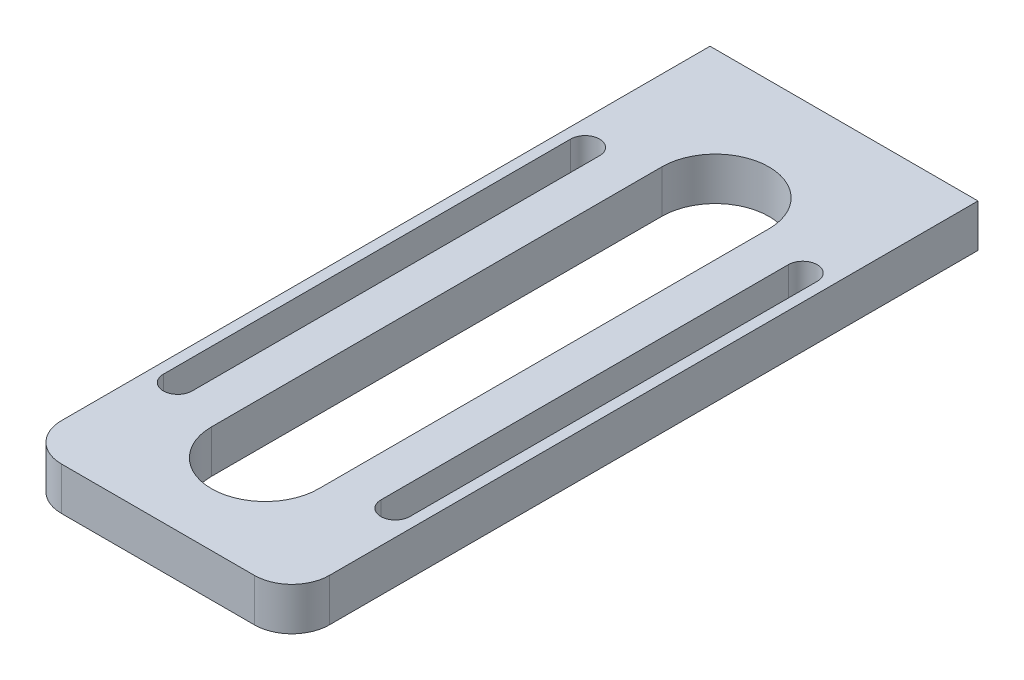
ISO-10303-21;
HEADER;
FILE_DESCRIPTION(('STEP AP214'),'2;1');
FILE_NAME('part.step','',(''),(''),'','','');
FILE_SCHEMA(('AUTOMOTIVE_DESIGN { 1 0 10303 214 1 1 1 1 }'));
ENDSEC;
DATA;
#1=APPLICATION_CONTEXT('core data for automotive mechanical design processes');
#2=APPLICATION_PROTOCOL_DEFINITION('international standard','automotive_design',2000,#1);
#3=PRODUCT_CONTEXT('',#1,'mechanical');
#4=PRODUCT('Part','Part','',(#3));
#5=PRODUCT_RELATED_PRODUCT_CATEGORY('part','',(#4));
#6=PRODUCT_DEFINITION_FORMATION('','',#4);
#7=PRODUCT_DEFINITION_CONTEXT('part definition',#1,'design');
#8=PRODUCT_DEFINITION('design','',#6,#7);
#9=PRODUCT_DEFINITION_SHAPE('','',#8);
#10=(LENGTH_UNIT() NAMED_UNIT(*) SI_UNIT(.MILLI.,.METRE.));
#11=(NAMED_UNIT(*) PLANE_ANGLE_UNIT() SI_UNIT($,.RADIAN.));
#12=(NAMED_UNIT(*) SI_UNIT($,.STERADIAN.) SOLID_ANGLE_UNIT());
#13=UNCERTAINTY_MEASURE_WITH_UNIT(LENGTH_MEASURE(1.E-05),#10,'distance_accuracy_value','');
#14=(GEOMETRIC_REPRESENTATION_CONTEXT(3) GLOBAL_UNCERTAINTY_ASSIGNED_CONTEXT((#13)) GLOBAL_UNIT_ASSIGNED_CONTEXT((#10,
#11,#12)) REPRESENTATION_CONTEXT('',''));
#15=CARTESIAN_POINT('',(0.,0.,0.));
#16=DIRECTION('',(0.,0.,1.));
#17=DIRECTION('',(1.,0.,0.));
#18=AXIS2_PLACEMENT_3D('',#15,#16,#17);
#19=CARTESIAN_POINT('',(-7.50000000000001,0.,-27.));
#20=DIRECTION('',(0.,0.,-1.));
#21=DIRECTION('',(-1.,0.,0.));
#22=AXIS2_PLACEMENT_3D('',#19,#20,#21);
#23=PLANE('',#22);
#24=CARTESIAN_POINT('',(-7.50000000000001,0.,-27.));
#25=DIRECTION('',(0.,0.,1.));
#26=DIRECTION('',(1.,0.,0.));
#27=AXIS2_PLACEMENT_3D('',#24,#25,#26);
#28=CIRCLE('',#27,1.25);
#29=CARTESIAN_POINT('',(-6.25000000000001,0.,-27.));
#30=VERTEX_POINT('',#29);
#31=EDGE_CURVE('E20',#30,#30,#28,.F.);
#32=ORIENTED_EDGE('',*,*,#31,.T.);
#33=EDGE_LOOP('',(#32));
#34=FACE_BOUND('',#33,.T.);
#35=ADVANCED_FACE('F17',(#34),#23,.T.);
#36=CARTESIAN_POINT('',(7.49999999999999,0.,-27.));
#37=DIRECTION('',(0.,0.,-1.));
#38=DIRECTION('',(-1.,0.,0.));
#39=AXIS2_PLACEMENT_3D('',#36,#37,#38);
#40=PLANE('',#39);
#41=CARTESIAN_POINT('',(7.49999999999999,0.,-27.));
#42=DIRECTION('',(0.,0.,1.));
#43=DIRECTION('',(1.,0.,0.));
#44=AXIS2_PLACEMENT_3D('',#41,#42,#43);
#45=CIRCLE('',#44,1.25);
#46=CARTESIAN_POINT('',(8.74999999999999,0.,-27.));
#47=VERTEX_POINT('',#46);
#48=EDGE_CURVE('E215',#47,#47,#45,.F.);
#49=ORIENTED_EDGE('',*,*,#48,.T.);
#50=EDGE_LOOP('',(#49));
#51=FACE_BOUND('',#50,.T.);
#52=ADVANCED_FACE('F282',(#51),#40,.T.);
#53=CARTESIAN_POINT('',(-7.50000000000001,0.,-32.));
#54=DIRECTION('',(0.,0.,1.));
#55=DIRECTION('',(1.,0.,0.));
#56=AXIS2_PLACEMENT_3D('',#53,#54,#55);
#57=CYLINDRICAL_SURFACE('',#56,1.25);
#58=ORIENTED_EDGE('',*,*,#31,.F.);
#59=EDGE_LOOP('',(#58));
#60=FACE_BOUND('',#59,.T.);
#61=CARTESIAN_POINT('',(-7.50000000000001,0.,-32.));
#62=DIRECTION('',(0.,0.,1.));
#63=DIRECTION('',(1.,0.,0.));
#64=AXIS2_PLACEMENT_3D('',#61,#62,#63);
#65=CIRCLE('',#64,1.25);
#66=CARTESIAN_POINT('',(-6.25000000000001,0.,-32.));
#67=VERTEX_POINT('',#66);
#68=EDGE_CURVE('E182',#67,#67,#65,.T.);
#69=ORIENTED_EDGE('',*,*,#68,.F.);
#70=EDGE_LOOP('',(#69));
#71=FACE_BOUND('',#70,.T.);
#72=ADVANCED_FACE('F278',(#60,#71),#57,.F.);
#73=CARTESIAN_POINT('',(7.49999999999999,0.,-32.));
#74=DIRECTION('',(0.,0.,1.));
#75=DIRECTION('',(1.,0.,0.));
#76=AXIS2_PLACEMENT_3D('',#73,#74,#75);
#77=CYLINDRICAL_SURFACE('',#76,1.25);
#78=ORIENTED_EDGE('',*,*,#48,.F.);
#79=EDGE_LOOP('',(#78));
#80=FACE_BOUND('',#79,.T.);
#81=CARTESIAN_POINT('',(7.49999999999999,0.,-32.));
#82=DIRECTION('',(0.,0.,1.));
#83=DIRECTION('',(1.,0.,0.));
#84=AXIS2_PLACEMENT_3D('',#81,#82,#83);
#85=CIRCLE('',#84,1.25);
#86=CARTESIAN_POINT('',(8.74999999999999,0.,-32.));
#87=VERTEX_POINT('',#86);
#88=EDGE_CURVE('E219',#87,#87,#85,.T.);
#89=ORIENTED_EDGE('',*,*,#88,.F.);
#90=EDGE_LOOP('',(#89));
#91=FACE_BOUND('',#90,.T.);
#92=ADVANCED_FACE('F281',(#80,#91),#77,.F.);
#93=CARTESIAN_POINT('',(0.,2.,0.));
#94=DIRECTION('',(0.,1.,0.));
#95=DIRECTION('',(0.,0.,1.));
#96=AXIS2_PLACEMENT_3D('',#93,#94,#95);
#97=PLANE('',#96);
#98=CARTESIAN_POINT('',(-10.15,2.,20.));
#99=DIRECTION('',(0.,-1.,0.));
#100=DIRECTION('',(0.,0.,-1.));
#101=AXIS2_PLACEMENT_3D('',#98,#99,#100);
#102=CIRCLE('',#101,1.35);
#103=CARTESIAN_POINT('',(-8.8,2.,20.));
#104=VERTEX_POINT('',#103);
#105=CARTESIAN_POINT('',(-11.5,2.,20.));
#106=VERTEX_POINT('',#105);
#107=EDGE_CURVE('E253',#104,#106,#102,.T.);
#108=ORIENTED_EDGE('',*,*,#107,.T.);
#109=DIRECTION('',(0.,0.,1.));
#110=VECTOR('',#109,1.);
#111=CARTESIAN_POINT('',(-11.5,2.,20.));
#112=LINE('',#111,#110);
#113=CARTESIAN_POINT('',(-11.5,2.,-18.));
#114=VERTEX_POINT('',#113);
#115=EDGE_CURVE('E190',#106,#114,#112,.F.);
#116=ORIENTED_EDGE('',*,*,#115,.T.);
#117=CARTESIAN_POINT('',(-10.15,2.,-18.));
#118=DIRECTION('',(0.,-1.,0.));
#119=DIRECTION('',(0.,0.,-1.));
#120=AXIS2_PLACEMENT_3D('',#117,#118,#119);
#121=CIRCLE('',#120,1.35);
#122=CARTESIAN_POINT('',(-8.8,2.,-18.));
#123=VERTEX_POINT('',#122);
#124=EDGE_CURVE('E250',#114,#123,#121,.T.);
#125=ORIENTED_EDGE('',*,*,#124,.T.);
#126=DIRECTION('',(0.,0.,-1.));
#127=VECTOR('',#126,1.);
#128=CARTESIAN_POINT('',(-8.8,2.,-18.));
#129=LINE('',#128,#127);
#130=EDGE_CURVE('E186',#123,#104,#129,.F.);
#131=ORIENTED_EDGE('',*,*,#130,.T.);
#132=EDGE_LOOP('',(#108,#116,#125,#131));
#133=FACE_BOUND('',#132,.T.);
#134=DIRECTION('',(0.,0.,1.));
#135=VECTOR('',#134,1.);
#136=CARTESIAN_POINT('',(-5.,2.,22.));
#137=LINE('',#136,#135);
#138=CARTESIAN_POINT('',(-5.,2.,22.));
#139=VERTEX_POINT('',#138);
#140=CARTESIAN_POINT('',(-5.,2.,-20.));
#141=VERTEX_POINT('',#140);
#142=EDGE_CURVE('E197',#139,#141,#137,.F.);
#143=ORIENTED_EDGE('',*,*,#142,.T.);
#144=CARTESIAN_POINT('',(0.,2.,-20.));
#145=DIRECTION('',(0.,-1.,0.));
#146=DIRECTION('',(0.,0.,-1.));
#147=AXIS2_PLACEMENT_3D('',#144,#145,#146);
#148=CIRCLE('',#147,5.);
#149=CARTESIAN_POINT('',(5.,2.,-20.));
#150=VERTEX_POINT('',#149);
#151=EDGE_CURVE('E255',#141,#150,#148,.T.);
#152=ORIENTED_EDGE('',*,*,#151,.T.);
#153=DIRECTION('',(0.,0.,-1.));
#154=VECTOR('',#153,1.);
#155=CARTESIAN_POINT('',(5.,2.,-20.));
#156=LINE('',#155,#154);
#157=CARTESIAN_POINT('',(5.,2.,22.));
#158=VERTEX_POINT('',#157);
#159=EDGE_CURVE('E193',#150,#158,#156,.F.);
#160=ORIENTED_EDGE('',*,*,#159,.T.);
#161=CARTESIAN_POINT('',(0.,2.,22.));
#162=DIRECTION('',(0.,-1.,0.));
#163=DIRECTION('',(0.,0.,-1.));
#164=AXIS2_PLACEMENT_3D('',#161,#162,#163);
#165=CIRCLE('',#164,5.);
#166=EDGE_CURVE('E257',#158,#139,#165,.T.);
#167=ORIENTED_EDGE('',*,*,#166,.T.);
#168=EDGE_LOOP('',(#143,#152,#160,#167));
#169=FACE_BOUND('',#168,.T.);
#170=DIRECTION('',(0.,0.,1.));
#171=VECTOR('',#170,1.);
#172=CARTESIAN_POINT('',(8.8,2.,20.));
#173=LINE('',#172,#171);
#174=CARTESIAN_POINT('',(8.8,2.,20.));
#175=VERTEX_POINT('',#174);
#176=CARTESIAN_POINT('',(8.8,2.,-18.));
#177=VERTEX_POINT('',#176);
#178=EDGE_CURVE('E206',#175,#177,#173,.F.);
#179=ORIENTED_EDGE('',*,*,#178,.T.);
#180=CARTESIAN_POINT('',(10.15,2.,-18.));
#181=DIRECTION('',(0.,-1.,0.));
#182=DIRECTION('',(0.,0.,-1.));
#183=AXIS2_PLACEMENT_3D('',#180,#181,#182);
#184=CIRCLE('',#183,1.35);
#185=CARTESIAN_POINT('',(11.5,2.,-18.));
#186=VERTEX_POINT('',#185);
#187=EDGE_CURVE('E259',#177,#186,#184,.T.);
#188=ORIENTED_EDGE('',*,*,#187,.T.);
#189=DIRECTION('',(0.,0.,-1.));
#190=VECTOR('',#189,1.);
#191=CARTESIAN_POINT('',(11.5,2.,-18.));
#192=LINE('',#191,#190);
#193=CARTESIAN_POINT('',(11.5,2.,20.));
#194=VERTEX_POINT('',#193);
#195=EDGE_CURVE('E201',#186,#194,#192,.F.);
#196=ORIENTED_EDGE('',*,*,#195,.T.);
#197=CARTESIAN_POINT('',(10.15,2.,20.));
#198=DIRECTION('',(0.,-1.,0.));
#199=DIRECTION('',(0.,0.,-1.));
#200=AXIS2_PLACEMENT_3D('',#197,#198,#199);
#201=CIRCLE('',#200,1.35);
#202=EDGE_CURVE('E261',#194,#175,#201,.T.);
#203=ORIENTED_EDGE('',*,*,#202,.T.);
#204=EDGE_LOOP('',(#179,#188,#196,#203));
#205=FACE_BOUND('',#204,.T.);
#206=CARTESIAN_POINT('',(-8.99999999999998,2.,28.5));
#207=DIRECTION('',(0.,1.,0.));
#208=DIRECTION('',(0.,0.,1.));
#209=AXIS2_PLACEMENT_3D('',#206,#207,#208);
#210=CIRCLE('',#209,3.50000000000001);
#211=CARTESIAN_POINT('',(-8.99999999999998,2.,32.));
#212=VERTEX_POINT('',#211);
#213=CARTESIAN_POINT('',(-12.5,2.,28.5));
#214=VERTEX_POINT('',#213);
#215=EDGE_CURVE('E138',#212,#214,#210,.F.);
#216=ORIENTED_EDGE('',*,*,#215,.F.);
#217=DIRECTION('',(1.,0.,0.));
#218=VECTOR('',#217,1.);
#219=CARTESIAN_POINT('',(-8.99999999999999,2.,32.));
#220=LINE('',#219,#218);
#221=CARTESIAN_POINT('',(9.,2.,32.));
#222=VERTEX_POINT('',#221);
#223=EDGE_CURVE('E132',#222,#212,#220,.F.);
#224=ORIENTED_EDGE('',*,*,#223,.F.);
#225=CARTESIAN_POINT('',(9.,2.,28.5));
#226=DIRECTION('',(0.,1.,0.));
#227=DIRECTION('',(0.,0.,1.));
#228=AXIS2_PLACEMENT_3D('',#225,#226,#227);
#229=CIRCLE('',#228,3.50000000000001);
#230=CARTESIAN_POINT('',(12.5,2.,28.5));
#231=VERTEX_POINT('',#230);
#232=EDGE_CURVE('E264',#231,#222,#229,.F.);
#233=ORIENTED_EDGE('',*,*,#232,.F.);
#234=DIRECTION('',(0.,0.,-1.));
#235=VECTOR('',#234,1.);
#236=CARTESIAN_POINT('',(12.5,2.,28.5));
#237=LINE('',#236,#235);
#238=CARTESIAN_POINT('',(12.5,2.,-32.));
#239=VERTEX_POINT('',#238);
#240=EDGE_CURVE('E213',#239,#231,#237,.F.);
#241=ORIENTED_EDGE('',*,*,#240,.F.);
#242=DIRECTION('',(-1.,0.,0.));
#243=VECTOR('',#242,1.);
#244=CARTESIAN_POINT('',(12.5,2.,-32.));
#245=LINE('',#244,#243);
#246=CARTESIAN_POINT('',(-12.5,2.,-32.));
#247=VERTEX_POINT('',#246);
#248=EDGE_CURVE('E183',#247,#239,#245,.F.);
#249=ORIENTED_EDGE('',*,*,#248,.F.);
#250=DIRECTION('',(0.,0.,1.));
#251=VECTOR('',#250,1.);
#252=CARTESIAN_POINT('',(-12.5,2.,-32.));
#253=LINE('',#252,#251);
#254=EDGE_CURVE('E144',#214,#247,#253,.F.);
#255=ORIENTED_EDGE('',*,*,#254,.F.);
#256=EDGE_LOOP('',(#216,#224,#233,#241,#249,#255));
#257=FACE_BOUND('',#256,.T.);
#258=ADVANCED_FACE('F297',(#133,#169,#205,#257),#97,.T.);
#259=CARTESIAN_POINT('',(12.5,0.,28.5));
#260=DIRECTION('',(1.,0.,0.));
#261=DIRECTION('',(0.,0.,-1.));
#262=AXIS2_PLACEMENT_3D('',#259,#260,#261);
#263=PLANE('',#262);
#264=DIRECTION('',(0.,1.,0.));
#265=VECTOR('',#264,1.);
#266=CARTESIAN_POINT('',(12.5,0.,28.5));
#267=LINE('',#266,#265);
#268=CARTESIAN_POINT('',(12.5,-2.,28.5));
#269=VERTEX_POINT('',#268);
#270=EDGE_CURVE('E266',#269,#231,#267,.T.);
#271=ORIENTED_EDGE('',*,*,#270,.F.);
#272=DIRECTION('',(0.,0.,1.));
#273=VECTOR('',#272,1.);
#274=CARTESIAN_POINT('',(12.5,-2.,0.));
#275=LINE('',#274,#273);
#276=CARTESIAN_POINT('',(12.5,-2.,-32.));
#277=VERTEX_POINT('',#276);
#278=EDGE_CURVE('E172',#269,#277,#275,.F.);
#279=ORIENTED_EDGE('',*,*,#278,.T.);
#280=DIRECTION('',(0.,1.,0.));
#281=VECTOR('',#280,1.);
#282=CARTESIAN_POINT('',(12.5,0.,-32.));
#283=LINE('',#282,#281);
#284=EDGE_CURVE('E171',#239,#277,#283,.F.);
#285=ORIENTED_EDGE('',*,*,#284,.F.);
#286=ORIENTED_EDGE('',*,*,#240,.T.);
#287=EDGE_LOOP('',(#271,#279,#285,#286));
#288=FACE_BOUND('',#287,.T.);
#289=ADVANCED_FACE('F287',(#288),#263,.T.);
#290=CARTESIAN_POINT('',(12.5,0.,-32.));
#291=DIRECTION('',(0.,0.,-1.));
#292=DIRECTION('',(-1.,0.,0.));
#293=AXIS2_PLACEMENT_3D('',#290,#291,#292);
#294=PLANE('',#293);
#295=ORIENTED_EDGE('',*,*,#88,.T.);
#296=EDGE_LOOP('',(#295));
#297=FACE_BOUND('',#296,.T.);
#298=ORIENTED_EDGE('',*,*,#68,.T.);
#299=EDGE_LOOP('',(#298));
#300=FACE_BOUND('',#299,.T.);
#301=ORIENTED_EDGE('',*,*,#284,.T.);
#302=DIRECTION('',(1.,0.,0.));
#303=VECTOR('',#302,1.);
#304=CARTESIAN_POINT('',(0.,-2.,-32.));
#305=LINE('',#304,#303);
#306=CARTESIAN_POINT('',(-12.5,-2.,-32.));
#307=VERTEX_POINT('',#306);
#308=EDGE_CURVE('E164',#277,#307,#305,.F.);
#309=ORIENTED_EDGE('',*,*,#308,.T.);
#310=DIRECTION('',(0.,1.,0.));
#311=VECTOR('',#310,1.);
#312=CARTESIAN_POINT('',(-12.5,0.,-32.));
#313=LINE('',#312,#311);
#314=EDGE_CURVE('E152',#247,#307,#313,.F.);
#315=ORIENTED_EDGE('',*,*,#314,.F.);
#316=ORIENTED_EDGE('',*,*,#248,.T.);
#317=EDGE_LOOP('',(#301,#309,#315,#316));
#318=FACE_BOUND('',#317,.T.);
#319=ADVANCED_FACE('F169',(#297,#300,#318),#294,.T.);
#320=CARTESIAN_POINT('',(-12.5,0.,-32.));
#321=DIRECTION('',(-1.,0.,0.));
#322=DIRECTION('',(0.,0.,1.));
#323=AXIS2_PLACEMENT_3D('',#320,#321,#322);
#324=PLANE('',#323);
#325=ORIENTED_EDGE('',*,*,#314,.T.);
#326=DIRECTION('',(0.,0.,1.));
#327=VECTOR('',#326,1.);
#328=CARTESIAN_POINT('',(-12.5,-2.,0.));
#329=LINE('',#328,#327);
#330=CARTESIAN_POINT('',(-12.5,-2.,28.5));
#331=VERTEX_POINT('',#330);
#332=EDGE_CURVE('E155',#307,#331,#329,.T.);
#333=ORIENTED_EDGE('',*,*,#332,.T.);
#334=DIRECTION('',(0.,1.,0.));
#335=VECTOR('',#334,1.);
#336=CARTESIAN_POINT('',(-12.5,0.,28.5));
#337=LINE('',#336,#335);
#338=EDGE_CURVE('E212',#214,#331,#337,.F.);
#339=ORIENTED_EDGE('',*,*,#338,.F.);
#340=ORIENTED_EDGE('',*,*,#254,.T.);
#341=EDGE_LOOP('',(#325,#333,#339,#340));
#342=FACE_BOUND('',#341,.T.);
#343=ADVANCED_FACE('F154',(#342),#324,.T.);
#344=CARTESIAN_POINT('',(-8.99999999999998,0.,28.5));
#345=DIRECTION('',(0.,1.,0.));
#346=DIRECTION('',(0.,0.,1.));
#347=AXIS2_PLACEMENT_3D('',#344,#345,#346);
#348=CYLINDRICAL_SURFACE('',#347,3.50000000000001);
#349=ORIENTED_EDGE('',*,*,#338,.T.);
#350=CARTESIAN_POINT('',(-8.99999999999998,-2.,28.5));
#351=DIRECTION('',(0.,1.,0.));
#352=DIRECTION('',(0.,0.,1.));
#353=AXIS2_PLACEMENT_3D('',#350,#351,#352);
#354=CIRCLE('',#353,3.50000000000001);
#355=CARTESIAN_POINT('',(-8.99999999999998,-2.,32.));
#356=VERTEX_POINT('',#355);
#357=EDGE_CURVE('E167',#331,#356,#354,.T.);
#358=ORIENTED_EDGE('',*,*,#357,.T.);
#359=DIRECTION('',(0.,1.,0.));
#360=VECTOR('',#359,1.);
#361=CARTESIAN_POINT('',(-8.99999999999999,0.,32.));
#362=LINE('',#361,#360);
#363=EDGE_CURVE('E211',#212,#356,#362,.F.);
#364=ORIENTED_EDGE('',*,*,#363,.F.);
#365=ORIENTED_EDGE('',*,*,#215,.T.);
#366=EDGE_LOOP('',(#349,#358,#364,#365));
#367=FACE_BOUND('',#366,.T.);
#368=ADVANCED_FACE('F295',(#367),#348,.T.);
#369=CARTESIAN_POINT('',(-8.99999999999999,0.,32.));
#370=DIRECTION('',(0.,0.,1.));
#371=DIRECTION('',(1.,0.,0.));
#372=AXIS2_PLACEMENT_3D('',#369,#370,#371);
#373=PLANE('',#372);
#374=ORIENTED_EDGE('',*,*,#363,.T.);
#375=DIRECTION('',(1.,0.,0.));
#376=VECTOR('',#375,1.);
#377=CARTESIAN_POINT('',(0.,-2.,32.));
#378=LINE('',#377,#376);
#379=CARTESIAN_POINT('',(9.,-2.,32.));
#380=VERTEX_POINT('',#379);
#381=EDGE_CURVE('E248',#356,#380,#378,.T.);
#382=ORIENTED_EDGE('',*,*,#381,.T.);
#383=DIRECTION('',(0.,1.,0.));
#384=VECTOR('',#383,1.);
#385=CARTESIAN_POINT('',(9.,0.,32.));
#386=LINE('',#385,#384);
#387=EDGE_CURVE('E263',#222,#380,#386,.F.);
#388=ORIENTED_EDGE('',*,*,#387,.F.);
#389=ORIENTED_EDGE('',*,*,#223,.T.);
#390=EDGE_LOOP('',(#374,#382,#388,#389));
#391=FACE_BOUND('',#390,.T.);
#392=ADVANCED_FACE('F358',(#391),#373,.T.);
#393=CARTESIAN_POINT('',(9.,0.,28.5));
#394=DIRECTION('',(0.,1.,0.));
#395=DIRECTION('',(0.,0.,1.));
#396=AXIS2_PLACEMENT_3D('',#393,#394,#395);
#397=CYLINDRICAL_SURFACE('',#396,3.50000000000001);
#398=ORIENTED_EDGE('',*,*,#387,.T.);
#399=CARTESIAN_POINT('',(9.,-2.,28.5));
#400=DIRECTION('',(0.,1.,0.));
#401=DIRECTION('',(0.,0.,1.));
#402=AXIS2_PLACEMENT_3D('',#399,#400,#401);
#403=CIRCLE('',#402,3.50000000000001);
#404=EDGE_CURVE('E245',#380,#269,#403,.T.);
#405=ORIENTED_EDGE('',*,*,#404,.T.);
#406=ORIENTED_EDGE('',*,*,#270,.T.);
#407=ORIENTED_EDGE('',*,*,#232,.T.);
#408=EDGE_LOOP('',(#398,#405,#406,#407));
#409=FACE_BOUND('',#408,.T.);
#410=ADVANCED_FACE('F354',(#409),#397,.T.);
#411=CARTESIAN_POINT('',(10.15,2.,20.));
#412=DIRECTION('',(0.,-1.,0.));
#413=DIRECTION('',(0.,0.,-1.));
#414=AXIS2_PLACEMENT_3D('',#411,#412,#413);
#415=CYLINDRICAL_SURFACE('',#414,1.35);
#416=DIRECTION('',(0.,1.,0.));
#417=VECTOR('',#416,1.);
#418=CARTESIAN_POINT('',(8.8,2.,20.));
#419=LINE('',#418,#417);
#420=CARTESIAN_POINT('',(8.8,-2.,20.));
#421=VERTEX_POINT('',#420);
#422=EDGE_CURVE('E209',#421,#175,#419,.T.);
#423=ORIENTED_EDGE('',*,*,#422,.T.);
#424=ORIENTED_EDGE('',*,*,#202,.F.);
#425=DIRECTION('',(0.,1.,0.));
#426=VECTOR('',#425,1.);
#427=CARTESIAN_POINT('',(11.5,2.,20.));
#428=LINE('',#427,#426);
#429=CARTESIAN_POINT('',(11.5,-2.,20.));
#430=VERTEX_POINT('',#429);
#431=EDGE_CURVE('E204',#194,#430,#428,.F.);
#432=ORIENTED_EDGE('',*,*,#431,.T.);
#433=CARTESIAN_POINT('',(10.15,-2.,20.));
#434=DIRECTION('',(0.,-1.,0.));
#435=DIRECTION('',(0.,0.,-1.));
#436=AXIS2_PLACEMENT_3D('',#433,#434,#435);
#437=CIRCLE('',#436,1.35);
#438=EDGE_CURVE('E242',#430,#421,#437,.T.);
#439=ORIENTED_EDGE('',*,*,#438,.T.);
#440=EDGE_LOOP('',(#423,#424,#432,#439));
#441=FACE_BOUND('',#440,.T.);
#442=ADVANCED_FACE('F350',(#441),#415,.F.);
#443=CARTESIAN_POINT('',(8.8,2.,20.));
#444=DIRECTION('',(-1.,0.,0.));
#445=DIRECTION('',(0.,0.,1.));
#446=AXIS2_PLACEMENT_3D('',#443,#444,#445);
#447=PLANE('',#446);
#448=DIRECTION('',(0.,-1.,0.));
#449=VECTOR('',#448,1.);
#450=CARTESIAN_POINT('',(8.8,2.,-18.));
#451=LINE('',#450,#449);
#452=CARTESIAN_POINT('',(8.8,-2.,-18.));
#453=VERTEX_POINT('',#452);
#454=EDGE_CURVE('E208',#453,#177,#451,.F.);
#455=ORIENTED_EDGE('',*,*,#454,.T.);
#456=ORIENTED_EDGE('',*,*,#178,.F.);
#457=ORIENTED_EDGE('',*,*,#422,.F.);
#458=DIRECTION('',(0.,0.,1.));
#459=VECTOR('',#458,1.);
#460=CARTESIAN_POINT('',(8.8,-2.,0.));
#461=LINE('',#460,#459);
#462=EDGE_CURVE('E241',#421,#453,#461,.F.);
#463=ORIENTED_EDGE('',*,*,#462,.T.);
#464=EDGE_LOOP('',(#455,#456,#457,#463));
#465=FACE_BOUND('',#464,.T.);
#466=ADVANCED_FACE('F346',(#465),#447,.F.);
#467=CARTESIAN_POINT('',(10.15,2.,-18.));
#468=DIRECTION('',(0.,-1.,0.));
#469=DIRECTION('',(0.,0.,-1.));
#470=AXIS2_PLACEMENT_3D('',#467,#468,#469);
#471=CYLINDRICAL_SURFACE('',#470,1.35);
#472=DIRECTION('',(0.,1.,0.));
#473=VECTOR('',#472,1.);
#474=CARTESIAN_POINT('',(11.5,2.,-18.));
#475=LINE('',#474,#473);
#476=CARTESIAN_POINT('',(11.5,-2.,-18.));
#477=VERTEX_POINT('',#476);
#478=EDGE_CURVE('E205',#477,#186,#475,.T.);
#479=ORIENTED_EDGE('',*,*,#478,.T.);
#480=ORIENTED_EDGE('',*,*,#187,.F.);
#481=ORIENTED_EDGE('',*,*,#454,.F.);
#482=CARTESIAN_POINT('',(10.15,-2.,-18.));
#483=DIRECTION('',(0.,-1.,0.));
#484=DIRECTION('',(0.,0.,-1.));
#485=AXIS2_PLACEMENT_3D('',#482,#483,#484);
#486=CIRCLE('',#485,1.35);
#487=EDGE_CURVE('E238',#453,#477,#486,.T.);
#488=ORIENTED_EDGE('',*,*,#487,.T.);
#489=EDGE_LOOP('',(#479,#480,#481,#488));
#490=FACE_BOUND('',#489,.T.);
#491=ADVANCED_FACE('F342',(#490),#471,.F.);
#492=CARTESIAN_POINT('',(11.5,2.,-18.));
#493=DIRECTION('',(1.,0.,0.));
#494=DIRECTION('',(0.,0.,-1.));
#495=AXIS2_PLACEMENT_3D('',#492,#493,#494);
#496=PLANE('',#495);
#497=ORIENTED_EDGE('',*,*,#431,.F.);
#498=ORIENTED_EDGE('',*,*,#195,.F.);
#499=ORIENTED_EDGE('',*,*,#478,.F.);
#500=DIRECTION('',(0.,0.,1.));
#501=VECTOR('',#500,1.);
#502=CARTESIAN_POINT('',(11.5,-2.,0.));
#503=LINE('',#502,#501);
#504=EDGE_CURVE('E237',#477,#430,#503,.T.);
#505=ORIENTED_EDGE('',*,*,#504,.T.);
#506=EDGE_LOOP('',(#497,#498,#499,#505));
#507=FACE_BOUND('',#506,.T.);
#508=ADVANCED_FACE('F338',(#507),#496,.F.);
#509=CARTESIAN_POINT('',(0.,2.,22.));
#510=DIRECTION('',(0.,-1.,0.));
#511=DIRECTION('',(0.,0.,-1.));
#512=AXIS2_PLACEMENT_3D('',#509,#510,#511);
#513=CYLINDRICAL_SURFACE('',#512,5.);
#514=DIRECTION('',(0.,1.,0.));
#515=VECTOR('',#514,1.);
#516=CARTESIAN_POINT('',(-5.,2.,22.));
#517=LINE('',#516,#515);
#518=CARTESIAN_POINT('',(-5.,-2.,22.));
#519=VERTEX_POINT('',#518);
#520=EDGE_CURVE('E200',#519,#139,#517,.T.);
#521=ORIENTED_EDGE('',*,*,#520,.T.);
#522=ORIENTED_EDGE('',*,*,#166,.F.);
#523=DIRECTION('',(0.,1.,0.));
#524=VECTOR('',#523,1.);
#525=CARTESIAN_POINT('',(5.,2.,22.));
#526=LINE('',#525,#524);
#527=CARTESIAN_POINT('',(5.,-2.,22.));
#528=VERTEX_POINT('',#527);
#529=EDGE_CURVE('E189',#158,#528,#526,.F.);
#530=ORIENTED_EDGE('',*,*,#529,.T.);
#531=CARTESIAN_POINT('',(0.,-2.,22.));
#532=DIRECTION('',(0.,-1.,0.));
#533=DIRECTION('',(0.,0.,-1.));
#534=AXIS2_PLACEMENT_3D('',#531,#532,#533);
#535=CIRCLE('',#534,5.);
#536=EDGE_CURVE('E234',#528,#519,#535,.T.);
#537=ORIENTED_EDGE('',*,*,#536,.T.);
#538=EDGE_LOOP('',(#521,#522,#530,#537));
#539=FACE_BOUND('',#538,.T.);
#540=ADVANCED_FACE('F334',(#539),#513,.F.);
#541=CARTESIAN_POINT('',(-5.,2.,22.));
#542=DIRECTION('',(-1.,0.,0.));
#543=DIRECTION('',(0.,0.,1.));
#544=AXIS2_PLACEMENT_3D('',#541,#542,#543);
#545=PLANE('',#544);
#546=DIRECTION('',(0.,-1.,0.));
#547=VECTOR('',#546,1.);
#548=CARTESIAN_POINT('',(-5.,2.,-20.));
#549=LINE('',#548,#547);
#550=CARTESIAN_POINT('',(-5.,-2.,-20.));
#551=VERTEX_POINT('',#550);
#552=EDGE_CURVE('E199',#551,#141,#549,.F.);
#553=ORIENTED_EDGE('',*,*,#552,.T.);
#554=ORIENTED_EDGE('',*,*,#142,.F.);
#555=ORIENTED_EDGE('',*,*,#520,.F.);
#556=DIRECTION('',(0.,0.,1.));
#557=VECTOR('',#556,1.);
#558=CARTESIAN_POINT('',(-5.,-2.,0.));
#559=LINE('',#558,#557);
#560=EDGE_CURVE('E233',#519,#551,#559,.F.);
#561=ORIENTED_EDGE('',*,*,#560,.T.);
#562=EDGE_LOOP('',(#553,#554,#555,#561));
#563=FACE_BOUND('',#562,.T.);
#564=ADVANCED_FACE('F330',(#563),#545,.F.);
#565=CARTESIAN_POINT('',(0.,2.,-20.));
#566=DIRECTION('',(0.,-1.,0.));
#567=DIRECTION('',(0.,0.,-1.));
#568=AXIS2_PLACEMENT_3D('',#565,#566,#567);
#569=CYLINDRICAL_SURFACE('',#568,5.);
#570=DIRECTION('',(0.,1.,0.));
#571=VECTOR('',#570,1.);
#572=CARTESIAN_POINT('',(5.,2.,-20.));
#573=LINE('',#572,#571);
#574=CARTESIAN_POINT('',(5.,-2.,-20.));
#575=VERTEX_POINT('',#574);
#576=EDGE_CURVE('E196',#575,#150,#573,.T.);
#577=ORIENTED_EDGE('',*,*,#576,.T.);
#578=ORIENTED_EDGE('',*,*,#151,.F.);
#579=ORIENTED_EDGE('',*,*,#552,.F.);
#580=CARTESIAN_POINT('',(0.,-2.,-20.));
#581=DIRECTION('',(0.,-1.,0.));
#582=DIRECTION('',(0.,0.,-1.));
#583=AXIS2_PLACEMENT_3D('',#580,#581,#582);
#584=CIRCLE('',#583,5.);
#585=EDGE_CURVE('E229',#551,#575,#584,.T.);
#586=ORIENTED_EDGE('',*,*,#585,.T.);
#587=EDGE_LOOP('',(#577,#578,#579,#586));
#588=FACE_BOUND('',#587,.T.);
#589=ADVANCED_FACE('F326',(#588),#569,.F.);
#590=CARTESIAN_POINT('',(5.,2.,-20.));
#591=DIRECTION('',(1.,0.,0.));
#592=DIRECTION('',(0.,0.,-1.));
#593=AXIS2_PLACEMENT_3D('',#590,#591,#592);
#594=PLANE('',#593);
#595=ORIENTED_EDGE('',*,*,#529,.F.);
#596=ORIENTED_EDGE('',*,*,#159,.F.);
#597=ORIENTED_EDGE('',*,*,#576,.F.);
#598=DIRECTION('',(0.,0.,1.));
#599=VECTOR('',#598,1.);
#600=CARTESIAN_POINT('',(5.,-2.,0.));
#601=LINE('',#600,#599);
#602=EDGE_CURVE('E232',#575,#528,#601,.T.);
#603=ORIENTED_EDGE('',*,*,#602,.T.);
#604=EDGE_LOOP('',(#595,#596,#597,#603));
#605=FACE_BOUND('',#604,.T.);
#606=ADVANCED_FACE('F322',(#605),#594,.F.);
#607=CARTESIAN_POINT('',(-8.8,2.,-18.));
#608=DIRECTION('',(1.,0.,0.));
#609=DIRECTION('',(0.,0.,-1.));
#610=AXIS2_PLACEMENT_3D('',#607,#608,#609);
#611=PLANE('',#610);
#612=DIRECTION('',(0.,-1.,0.));
#613=VECTOR('',#612,1.);
#614=CARTESIAN_POINT('',(-8.8,2.,20.));
#615=LINE('',#614,#613);
#616=CARTESIAN_POINT('',(-8.8,-2.,20.));
#617=VERTEX_POINT('',#616);
#618=EDGE_CURVE('E188',#617,#104,#615,.F.);
#619=ORIENTED_EDGE('',*,*,#618,.T.);
#620=ORIENTED_EDGE('',*,*,#130,.F.);
#621=DIRECTION('',(0.,-1.,0.));
#622=VECTOR('',#621,1.);
#623=CARTESIAN_POINT('',(-8.8,2.,-18.));
#624=LINE('',#623,#622);
#625=CARTESIAN_POINT('',(-8.8,-2.,-18.));
#626=VERTEX_POINT('',#625);
#627=EDGE_CURVE('E174',#123,#626,#624,.T.);
#628=ORIENTED_EDGE('',*,*,#627,.T.);
#629=DIRECTION('',(0.,0.,1.));
#630=VECTOR('',#629,1.);
#631=CARTESIAN_POINT('',(-8.8,-2.,0.));
#632=LINE('',#631,#630);
#633=EDGE_CURVE('E228',#626,#617,#632,.T.);
#634=ORIENTED_EDGE('',*,*,#633,.T.);
#635=EDGE_LOOP('',(#619,#620,#628,#634));
#636=FACE_BOUND('',#635,.T.);
#637=ADVANCED_FACE('F318',(#636),#611,.F.);
#638=CARTESIAN_POINT('',(-10.15,2.,20.));
#639=DIRECTION('',(0.,-1.,0.));
#640=DIRECTION('',(0.,0.,-1.));
#641=AXIS2_PLACEMENT_3D('',#638,#639,#640);
#642=CYLINDRICAL_SURFACE('',#641,1.35);
#643=DIRECTION('',(0.,1.,0.));
#644=VECTOR('',#643,1.);
#645=CARTESIAN_POINT('',(-11.5,2.,20.));
#646=LINE('',#645,#644);
#647=CARTESIAN_POINT('',(-11.5,-2.,20.));
#648=VERTEX_POINT('',#647);
#649=EDGE_CURVE('E192',#648,#106,#646,.T.);
#650=ORIENTED_EDGE('',*,*,#649,.T.);
#651=ORIENTED_EDGE('',*,*,#107,.F.);
#652=ORIENTED_EDGE('',*,*,#618,.F.);
#653=CARTESIAN_POINT('',(-10.15,-2.,20.));
#654=DIRECTION('',(0.,-1.,0.));
#655=DIRECTION('',(0.,0.,-1.));
#656=AXIS2_PLACEMENT_3D('',#653,#654,#655);
#657=CIRCLE('',#656,1.35);
#658=EDGE_CURVE('E225',#617,#648,#657,.T.);
#659=ORIENTED_EDGE('',*,*,#658,.T.);
#660=EDGE_LOOP('',(#650,#651,#652,#659));
#661=FACE_BOUND('',#660,.T.);
#662=ADVANCED_FACE('F314',(#661),#642,.F.);
#663=CARTESIAN_POINT('',(-11.5,2.,20.));
#664=DIRECTION('',(-1.,0.,0.));
#665=DIRECTION('',(0.,0.,1.));
#666=AXIS2_PLACEMENT_3D('',#663,#664,#665);
#667=PLANE('',#666);
#668=DIRECTION('',(0.,-1.,0.));
#669=VECTOR('',#668,1.);
#670=CARTESIAN_POINT('',(-11.5,2.,-18.));
#671=LINE('',#670,#669);
#672=CARTESIAN_POINT('',(-11.5,-2.,-18.));
#673=VERTEX_POINT('',#672);
#674=EDGE_CURVE('E34',#673,#114,#671,.F.);
#675=ORIENTED_EDGE('',*,*,#674,.T.);
#676=ORIENTED_EDGE('',*,*,#115,.F.);
#677=ORIENTED_EDGE('',*,*,#649,.F.);
#678=DIRECTION('',(0.,0.,1.));
#679=VECTOR('',#678,1.);
#680=CARTESIAN_POINT('',(-11.5,-2.,0.));
#681=LINE('',#680,#679);
#682=EDGE_CURVE('E26',#648,#673,#681,.F.);
#683=ORIENTED_EDGE('',*,*,#682,.T.);
#684=EDGE_LOOP('',(#675,#676,#677,#683));
#685=FACE_BOUND('',#684,.T.);
#686=ADVANCED_FACE('F307',(#685),#667,.F.);
#687=CARTESIAN_POINT('',(-10.15,2.,-18.));
#688=DIRECTION('',(0.,-1.,0.));
#689=DIRECTION('',(0.,0.,-1.));
#690=AXIS2_PLACEMENT_3D('',#687,#688,#689);
#691=CYLINDRICAL_SURFACE('',#690,1.35);
#692=ORIENTED_EDGE('',*,*,#627,.F.);
#693=ORIENTED_EDGE('',*,*,#124,.F.);
#694=ORIENTED_EDGE('',*,*,#674,.F.);
#695=CARTESIAN_POINT('',(-10.15,-2.,-18.));
#696=DIRECTION('',(0.,-1.,0.));
#697=DIRECTION('',(0.,0.,-1.));
#698=AXIS2_PLACEMENT_3D('',#695,#696,#697);
#699=CIRCLE('',#698,1.35);
#700=EDGE_CURVE('E11',#673,#626,#699,.T.);
#701=ORIENTED_EDGE('',*,*,#700,.T.);
#702=EDGE_LOOP('',(#692,#693,#694,#701));
#703=FACE_BOUND('',#702,.T.);
#704=ADVANCED_FACE('F301',(#703),#691,.F.);
#705=CARTESIAN_POINT('',(0.,-2.,0.));
#706=DIRECTION('',(0.,1.,0.));
#707=DIRECTION('',(0.,0.,1.));
#708=AXIS2_PLACEMENT_3D('',#705,#706,#707);
#709=PLANE('',#708);
#710=ORIENTED_EDGE('',*,*,#682,.F.);
#711=ORIENTED_EDGE('',*,*,#658,.F.);
#712=ORIENTED_EDGE('',*,*,#633,.F.);
#713=ORIENTED_EDGE('',*,*,#700,.F.);
#714=EDGE_LOOP('',(#710,#711,#712,#713));
#715=FACE_BOUND('',#714,.T.);
#716=ORIENTED_EDGE('',*,*,#585,.F.);
#717=ORIENTED_EDGE('',*,*,#560,.F.);
#718=ORIENTED_EDGE('',*,*,#536,.F.);
#719=ORIENTED_EDGE('',*,*,#602,.F.);
#720=EDGE_LOOP('',(#716,#717,#718,#719));
#721=FACE_BOUND('',#720,.T.);
#722=ORIENTED_EDGE('',*,*,#487,.F.);
#723=ORIENTED_EDGE('',*,*,#462,.F.);
#724=ORIENTED_EDGE('',*,*,#438,.F.);
#725=ORIENTED_EDGE('',*,*,#504,.F.);
#726=EDGE_LOOP('',(#722,#723,#724,#725));
#727=FACE_BOUND('',#726,.T.);
#728=ORIENTED_EDGE('',*,*,#381,.F.);
#729=ORIENTED_EDGE('',*,*,#357,.F.);
#730=ORIENTED_EDGE('',*,*,#332,.F.);
#731=ORIENTED_EDGE('',*,*,#308,.F.);
#732=ORIENTED_EDGE('',*,*,#278,.F.);
#733=ORIENTED_EDGE('',*,*,#404,.F.);
#734=EDGE_LOOP('',(#728,#729,#730,#731,#732,#733));
#735=FACE_BOUND('',#734,.T.);
#736=ADVANCED_FACE('F163',(#715,#721,#727,#735),#709,.F.);
#737=CLOSED_SHELL('',(#35,#52,#72,#92,#258,#289,#319,#343,#368,#392,#410,#442,#466,#491,#508,
#540,#564,#589,#606,#637,#662,#686,#704,#736));
#738=MANIFOLD_SOLID_BREP('B1',#737);
#739=ADVANCED_BREP_SHAPE_REPRESENTATION('',(#18,#738),#14);
#740=SHAPE_DEFINITION_REPRESENTATION(#9,#739);
ENDSEC;
END-ISO-10303-21;
